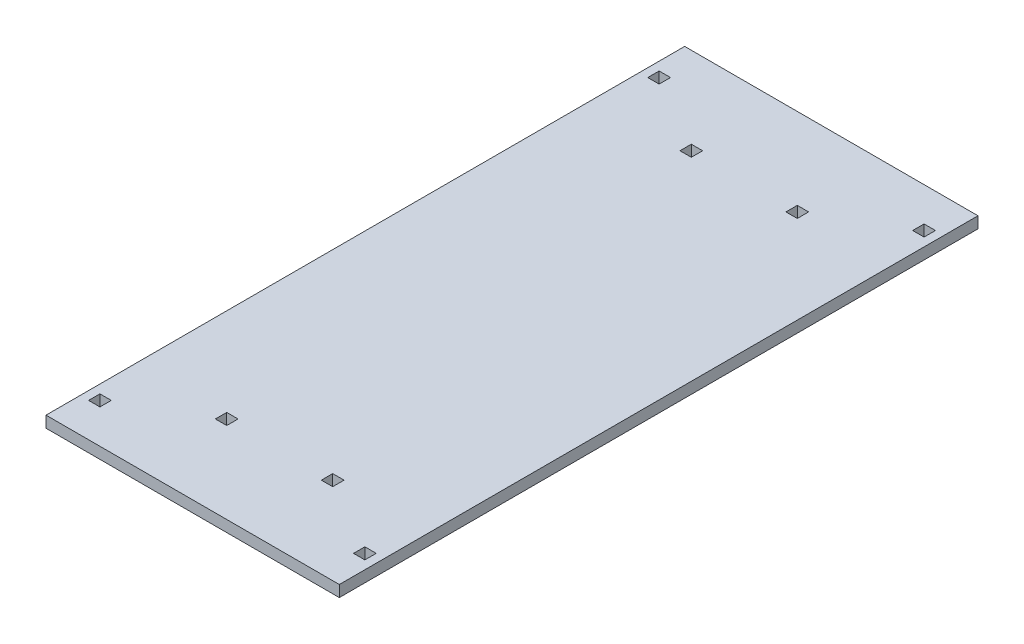
ISO-10303-21;
HEADER;
FILE_DESCRIPTION(('STEP AP214'),'2;1');
FILE_NAME('part.step','',(''),(''),'','','');
FILE_SCHEMA(('AUTOMOTIVE_DESIGN { 1 0 10303 214 1 1 1 1 }'));
ENDSEC;
DATA;
#1=APPLICATION_CONTEXT('core data for automotive mechanical design processes');
#2=APPLICATION_PROTOCOL_DEFINITION('international standard','automotive_design',2000,#1);
#3=PRODUCT_CONTEXT('',#1,'mechanical');
#4=PRODUCT('Part','Part','',(#3));
#5=PRODUCT_RELATED_PRODUCT_CATEGORY('part','',(#4));
#6=PRODUCT_DEFINITION_FORMATION('','',#4);
#7=PRODUCT_DEFINITION_CONTEXT('part definition',#1,'design');
#8=PRODUCT_DEFINITION('design','',#6,#7);
#9=PRODUCT_DEFINITION_SHAPE('','',#8);
#10=(LENGTH_UNIT() NAMED_UNIT(*) SI_UNIT(.MILLI.,.METRE.));
#11=(NAMED_UNIT(*) PLANE_ANGLE_UNIT() SI_UNIT($,.RADIAN.));
#12=(NAMED_UNIT(*) SI_UNIT($,.STERADIAN.) SOLID_ANGLE_UNIT());
#13=UNCERTAINTY_MEASURE_WITH_UNIT(LENGTH_MEASURE(1.E-05),#10,'distance_accuracy_value','');
#14=(GEOMETRIC_REPRESENTATION_CONTEXT(3) GLOBAL_UNCERTAINTY_ASSIGNED_CONTEXT((#13)) GLOBAL_UNIT_ASSIGNED_CONTEXT((#10,
#11,#12)) REPRESENTATION_CONTEXT('',''));
#15=CARTESIAN_POINT('',(0.,0.,0.));
#16=DIRECTION('',(0.,0.,1.));
#17=DIRECTION('',(1.,0.,0.));
#18=AXIS2_PLACEMENT_3D('',#15,#16,#17);
#19=CARTESIAN_POINT('',(0.,12.,0.));
#20=DIRECTION('',(0.,1.,0.));
#21=DIRECTION('',(0.,0.,1.));
#22=AXIS2_PLACEMENT_3D('',#19,#20,#21);
#23=PLANE('',#22);
#24=DIRECTION('',(0.,0.,1.));
#25=VECTOR('',#24,1.);
#26=CARTESIAN_POINT('',(-62.,12.,251.5));
#27=LINE('',#26,#25);
#28=CARTESIAN_POINT('',(-62.,12.,239.5));
#29=VERTEX_POINT('',#28);
#30=CARTESIAN_POINT('',(-62.,12.,251.5));
#31=VERTEX_POINT('',#30);
#32=EDGE_CURVE('E355',#29,#31,#27,.T.);
#33=ORIENTED_EDGE('',*,*,#32,.F.);
#34=DIRECTION('',(-1.,0.,0.));
#35=VECTOR('',#34,1.);
#36=CARTESIAN_POINT('',(-62.,12.,239.5));
#37=LINE('',#36,#35);
#38=CARTESIAN_POINT('',(-50.,12.,239.5));
#39=VERTEX_POINT('',#38);
#40=EDGE_CURVE('E345',#39,#29,#37,.T.);
#41=ORIENTED_EDGE('',*,*,#40,.F.);
#42=DIRECTION('',(0.,0.,-1.));
#43=VECTOR('',#42,1.);
#44=CARTESIAN_POINT('',(-50.,12.,251.5));
#45=LINE('',#44,#43);
#46=CARTESIAN_POINT('',(-50.,12.,251.5));
#47=VERTEX_POINT('',#46);
#48=EDGE_CURVE('E361',#47,#39,#45,.T.);
#49=ORIENTED_EDGE('',*,*,#48,.F.);
#50=DIRECTION('',(1.,0.,0.));
#51=VECTOR('',#50,1.);
#52=CARTESIAN_POINT('',(-62.,12.,251.5));
#53=LINE('',#52,#51);
#54=EDGE_CURVE('E357',#31,#47,#53,.T.);
#55=ORIENTED_EDGE('',*,*,#54,.F.);
#56=EDGE_LOOP('',(#33,#41,#49,#55));
#57=FACE_BOUND('',#56,.T.);
#58=DIRECTION('',(0.,0.,1.));
#59=VECTOR('',#58,1.);
#60=CARTESIAN_POINT('',(50.,12.,251.5));
#61=LINE('',#60,#59);
#62=CARTESIAN_POINT('',(50.,12.,239.5));
#63=VERTEX_POINT('',#62);
#64=CARTESIAN_POINT('',(50.,12.,251.5));
#65=VERTEX_POINT('',#64);
#66=EDGE_CURVE('E358',#63,#65,#61,.T.);
#67=ORIENTED_EDGE('',*,*,#66,.F.);
#68=DIRECTION('',(-1.,0.,0.));
#69=VECTOR('',#68,1.);
#70=CARTESIAN_POINT('',(50.,12.,239.5));
#71=LINE('',#70,#69);
#72=CARTESIAN_POINT('',(62.,12.,239.5));
#73=VERTEX_POINT('',#72);
#74=EDGE_CURVE('E384',#73,#63,#71,.T.);
#75=ORIENTED_EDGE('',*,*,#74,.F.);
#76=DIRECTION('',(0.,0.,-1.));
#77=VECTOR('',#76,1.);
#78=CARTESIAN_POINT('',(62.,12.,251.5));
#79=LINE('',#78,#77);
#80=CARTESIAN_POINT('',(62.,12.,251.5));
#81=VERTEX_POINT('',#80);
#82=EDGE_CURVE('E387',#81,#73,#79,.T.);
#83=ORIENTED_EDGE('',*,*,#82,.F.);
#84=DIRECTION('',(1.,0.,0.));
#85=VECTOR('',#84,1.);
#86=CARTESIAN_POINT('',(50.,12.,251.5));
#87=LINE('',#86,#85);
#88=EDGE_CURVE('E391',#65,#81,#87,.T.);
#89=ORIENTED_EDGE('',*,*,#88,.F.);
#90=EDGE_LOOP('',(#67,#75,#83,#89));
#91=FACE_BOUND('',#90,.T.);
#92=DIRECTION('',(0.,0.,1.));
#93=VECTOR('',#92,1.);
#94=CARTESIAN_POINT('',(134.,12.,289.5));
#95=LINE('',#94,#93);
#96=CARTESIAN_POINT('',(134.,12.,289.5));
#97=VERTEX_POINT('',#96);
#98=CARTESIAN_POINT('',(134.,12.,301.5));
#99=VERTEX_POINT('',#98);
#100=EDGE_CURVE('E449',#97,#99,#95,.T.);
#101=ORIENTED_EDGE('',*,*,#100,.F.);
#102=DIRECTION('',(-1.,0.,0.));
#103=VECTOR('',#102,1.);
#104=CARTESIAN_POINT('',(134.,12.,289.5));
#105=LINE('',#104,#103);
#106=CARTESIAN_POINT('',(146.,12.,289.5));
#107=VERTEX_POINT('',#106);
#108=EDGE_CURVE('E480',#107,#97,#105,.T.);
#109=ORIENTED_EDGE('',*,*,#108,.F.);
#110=DIRECTION('',(0.,0.,-1.));
#111=VECTOR('',#110,1.);
#112=CARTESIAN_POINT('',(146.,12.,289.5));
#113=LINE('',#112,#111);
#114=CARTESIAN_POINT('',(146.,12.,301.5));
#115=VERTEX_POINT('',#114);
#116=EDGE_CURVE('E483',#115,#107,#113,.T.);
#117=ORIENTED_EDGE('',*,*,#116,.F.);
#118=DIRECTION('',(1.,0.,0.));
#119=VECTOR('',#118,1.);
#120=CARTESIAN_POINT('',(134.,12.,301.5));
#121=LINE('',#120,#119);
#122=EDGE_CURVE('E487',#99,#115,#121,.T.);
#123=ORIENTED_EDGE('',*,*,#122,.F.);
#124=EDGE_LOOP('',(#101,#109,#117,#123));
#125=FACE_BOUND('',#124,.T.);
#126=DIRECTION('',(0.,0.,1.));
#127=VECTOR('',#126,1.);
#128=CARTESIAN_POINT('',(134.,12.,-301.5));
#129=LINE('',#128,#127);
#130=CARTESIAN_POINT('',(134.,12.,-301.5));
#131=VERTEX_POINT('',#130);
#132=CARTESIAN_POINT('',(134.,12.,-289.5));
#133=VERTEX_POINT('',#132);
#134=EDGE_CURVE('E415',#131,#133,#129,.T.);
#135=ORIENTED_EDGE('',*,*,#134,.F.);
#136=DIRECTION('',(-1.,0.,0.));
#137=VECTOR('',#136,1.);
#138=CARTESIAN_POINT('',(134.,12.,-301.5));
#139=LINE('',#138,#137);
#140=CARTESIAN_POINT('',(146.,12.,-301.5));
#141=VERTEX_POINT('',#140);
#142=EDGE_CURVE('E450',#141,#131,#139,.T.);
#143=ORIENTED_EDGE('',*,*,#142,.F.);
#144=DIRECTION('',(0.,0.,-1.));
#145=VECTOR('',#144,1.);
#146=CARTESIAN_POINT('',(146.,12.,-301.5));
#147=LINE('',#146,#145);
#148=CARTESIAN_POINT('',(146.,12.,-289.5));
#149=VERTEX_POINT('',#148);
#150=EDGE_CURVE('E453',#149,#141,#147,.T.);
#151=ORIENTED_EDGE('',*,*,#150,.F.);
#152=DIRECTION('',(1.,0.,0.));
#153=VECTOR('',#152,1.);
#154=CARTESIAN_POINT('',(134.,12.,-289.5));
#155=LINE('',#154,#153);
#156=EDGE_CURVE('E457',#133,#149,#155,.T.);
#157=ORIENTED_EDGE('',*,*,#156,.F.);
#158=EDGE_LOOP('',(#135,#143,#151,#157));
#159=FACE_BOUND('',#158,.T.);
#160=DIRECTION('',(0.,0.,1.));
#161=VECTOR('',#160,1.);
#162=CARTESIAN_POINT('',(-146.,12.,-301.5));
#163=LINE('',#162,#161);
#164=CARTESIAN_POINT('',(-146.,12.,-301.5));
#165=VERTEX_POINT('',#164);
#166=CARTESIAN_POINT('',(-146.,12.,-289.5));
#167=VERTEX_POINT('',#166);
#168=EDGE_CURVE('E426',#165,#167,#163,.T.);
#169=ORIENTED_EDGE('',*,*,#168,.F.);
#170=DIRECTION('',(-1.,0.,0.));
#171=VECTOR('',#170,1.);
#172=CARTESIAN_POINT('',(-146.,12.,-301.5));
#173=LINE('',#172,#171);
#174=CARTESIAN_POINT('',(-134.,12.,-301.5));
#175=VERTEX_POINT('',#174);
#176=EDGE_CURVE('E416',#175,#165,#173,.T.);
#177=ORIENTED_EDGE('',*,*,#176,.F.);
#178=DIRECTION('',(0.,0.,-1.));
#179=VECTOR('',#178,1.);
#180=CARTESIAN_POINT('',(-134.,12.,-301.5));
#181=LINE('',#180,#179);
#182=CARTESIAN_POINT('',(-134.,12.,-289.5));
#183=VERTEX_POINT('',#182);
#184=EDGE_CURVE('E419',#183,#175,#181,.T.);
#185=ORIENTED_EDGE('',*,*,#184,.F.);
#186=DIRECTION('',(1.,0.,0.));
#187=VECTOR('',#186,1.);
#188=CARTESIAN_POINT('',(-146.,12.,-289.5));
#189=LINE('',#188,#187);
#190=EDGE_CURVE('E423',#167,#183,#189,.T.);
#191=ORIENTED_EDGE('',*,*,#190,.F.);
#192=EDGE_LOOP('',(#169,#177,#185,#191));
#193=FACE_BOUND('',#192,.T.);
#194=DIRECTION('',(0.,0.,1.));
#195=VECTOR('',#194,1.);
#196=CARTESIAN_POINT('',(-146.,12.,301.5));
#197=LINE('',#196,#195);
#198=CARTESIAN_POINT('',(-146.,12.,289.5));
#199=VERTEX_POINT('',#198);
#200=CARTESIAN_POINT('',(-146.,12.,301.5));
#201=VERTEX_POINT('',#200);
#202=EDGE_CURVE('E428',#199,#201,#197,.T.);
#203=ORIENTED_EDGE('',*,*,#202,.F.);
#204=DIRECTION('',(-1.,0.,0.));
#205=VECTOR('',#204,1.);
#206=CARTESIAN_POINT('',(-134.,12.,289.5));
#207=LINE('',#206,#205);
#208=CARTESIAN_POINT('',(-134.,12.,289.5));
#209=VERTEX_POINT('',#208);
#210=EDGE_CURVE('E505',#209,#199,#207,.T.);
#211=ORIENTED_EDGE('',*,*,#210,.F.);
#212=DIRECTION('',(0.,0.,-1.));
#213=VECTOR('',#212,1.);
#214=CARTESIAN_POINT('',(-134.,12.,301.5));
#215=LINE('',#214,#213);
#216=CARTESIAN_POINT('',(-134.,12.,301.5));
#217=VERTEX_POINT('',#216);
#218=EDGE_CURVE('E519',#217,#209,#215,.T.);
#219=ORIENTED_EDGE('',*,*,#218,.F.);
#220=DIRECTION('',(1.,0.,0.));
#221=VECTOR('',#220,1.);
#222=CARTESIAN_POINT('',(-134.,12.,301.5));
#223=LINE('',#222,#221);
#224=EDGE_CURVE('E516',#201,#217,#223,.T.);
#225=ORIENTED_EDGE('',*,*,#224,.F.);
#226=EDGE_LOOP('',(#203,#211,#219,#225));
#227=FACE_BOUND('',#226,.T.);
#228=DIRECTION('',(-1.,0.,0.));
#229=VECTOR('',#228,1.);
#230=CARTESIAN_POINT('',(0.,12.,337.5));
#231=LINE('',#230,#229);
#232=CARTESIAN_POINT('',(155.,12.,337.5));
#233=VERTEX_POINT('',#232);
#234=CARTESIAN_POINT('',(-155.,12.,337.5));
#235=VERTEX_POINT('',#234);
#236=EDGE_CURVE('E533',#233,#235,#231,.T.);
#237=ORIENTED_EDGE('',*,*,#236,.F.);
#238=DIRECTION('',(0.,0.,-1.));
#239=VECTOR('',#238,1.);
#240=CARTESIAN_POINT('',(155.,12.,0.));
#241=LINE('',#240,#239);
#242=CARTESIAN_POINT('',(155.,12.,-337.5));
#243=VERTEX_POINT('',#242);
#244=EDGE_CURVE('E536',#233,#243,#241,.T.);
#245=ORIENTED_EDGE('',*,*,#244,.T.);
#246=DIRECTION('',(-1.,0.,0.));
#247=VECTOR('',#246,1.);
#248=CARTESIAN_POINT('',(0.,12.,-337.5));
#249=LINE('',#248,#247);
#250=CARTESIAN_POINT('',(-155.,12.,-337.5));
#251=VERTEX_POINT('',#250);
#252=EDGE_CURVE('E539',#243,#251,#249,.T.);
#253=ORIENTED_EDGE('',*,*,#252,.T.);
#254=DIRECTION('',(0.,0.,-1.));
#255=VECTOR('',#254,1.);
#256=CARTESIAN_POINT('',(-155.,12.,0.));
#257=LINE('',#256,#255);
#258=EDGE_CURVE('E541',#235,#251,#257,.T.);
#259=ORIENTED_EDGE('',*,*,#258,.F.);
#260=EDGE_LOOP('',(#237,#245,#253,#259));
#261=FACE_BOUND('',#260,.T.);
#262=DIRECTION('',(-1.,0.,0.));
#263=VECTOR('',#262,1.);
#264=CARTESIAN_POINT('',(50.,12.,-239.5));
#265=LINE('',#264,#263);
#266=CARTESIAN_POINT('',(62.,12.,-239.5));
#267=VERTEX_POINT('',#266);
#268=CARTESIAN_POINT('',(50.,12.,-239.5));
#269=VERTEX_POINT('',#268);
#270=EDGE_CURVE('E327',#267,#269,#265,.T.);
#271=ORIENTED_EDGE('',*,*,#270,.T.);
#272=DIRECTION('',(0.,0.,-1.));
#273=VECTOR('',#272,1.);
#274=CARTESIAN_POINT('',(50.,12.,-251.5));
#275=LINE('',#274,#273);
#276=CARTESIAN_POINT('',(50.,12.,-251.5));
#277=VERTEX_POINT('',#276);
#278=EDGE_CURVE('E64',#269,#277,#275,.T.);
#279=ORIENTED_EDGE('',*,*,#278,.T.);
#280=DIRECTION('',(1.,0.,0.));
#281=VECTOR('',#280,1.);
#282=CARTESIAN_POINT('',(50.,12.,-251.5));
#283=LINE('',#282,#281);
#284=CARTESIAN_POINT('',(62.,12.,-251.5));
#285=VERTEX_POINT('',#284);
#286=EDGE_CURVE('E318',#277,#285,#283,.T.);
#287=ORIENTED_EDGE('',*,*,#286,.T.);
#288=DIRECTION('',(0.,0.,1.));
#289=VECTOR('',#288,1.);
#290=CARTESIAN_POINT('',(62.,12.,-251.5));
#291=LINE('',#290,#289);
#292=EDGE_CURVE('E330',#285,#267,#291,.T.);
#293=ORIENTED_EDGE('',*,*,#292,.T.);
#294=EDGE_LOOP('',(#271,#279,#287,#293));
#295=FACE_BOUND('',#294,.T.);
#296=DIRECTION('',(-1.,0.,0.));
#297=VECTOR('',#296,1.);
#298=CARTESIAN_POINT('',(-62.,12.,-239.5));
#299=LINE('',#298,#297);
#300=CARTESIAN_POINT('',(-50.,12.,-239.5));
#301=VERTEX_POINT('',#300);
#302=CARTESIAN_POINT('',(-62.,12.,-239.5));
#303=VERTEX_POINT('',#302);
#304=EDGE_CURVE('E304',#301,#303,#299,.T.);
#305=ORIENTED_EDGE('',*,*,#304,.T.);
#306=DIRECTION('',(0.,0.,-1.));
#307=VECTOR('',#306,1.);
#308=CARTESIAN_POINT('',(-62.,12.,-251.5));
#309=LINE('',#308,#307);
#310=CARTESIAN_POINT('',(-62.,12.,-251.5));
#311=VERTEX_POINT('',#310);
#312=EDGE_CURVE('E56',#303,#311,#309,.T.);
#313=ORIENTED_EDGE('',*,*,#312,.T.);
#314=DIRECTION('',(1.,0.,0.));
#315=VECTOR('',#314,1.);
#316=CARTESIAN_POINT('',(-62.,12.,-251.5));
#317=LINE('',#316,#315);
#318=CARTESIAN_POINT('',(-50.,12.,-251.5));
#319=VERTEX_POINT('',#318);
#320=EDGE_CURVE('E295',#311,#319,#317,.T.);
#321=ORIENTED_EDGE('',*,*,#320,.T.);
#322=DIRECTION('',(0.,0.,1.));
#323=VECTOR('',#322,1.);
#324=CARTESIAN_POINT('',(-50.,12.,-251.5));
#325=LINE('',#324,#323);
#326=EDGE_CURVE('E298',#319,#301,#325,.T.);
#327=ORIENTED_EDGE('',*,*,#326,.T.);
#328=EDGE_LOOP('',(#305,#313,#321,#327));
#329=FACE_BOUND('',#328,.T.);
#330=ADVANCED_FACE('F41',(#57,#91,#125,#159,#193,#227,#261,#295,#329),#23,.T.);
#331=CARTESIAN_POINT('',(0.,0.,0.));
#332=DIRECTION('',(0.,1.,0.));
#333=DIRECTION('',(0.,0.,1.));
#334=AXIS2_PLACEMENT_3D('',#331,#332,#333);
#335=PLANE('',#334);
#336=DIRECTION('',(0.,0.,-1.));
#337=VECTOR('',#336,1.);
#338=CARTESIAN_POINT('',(50.,0.,-251.5));
#339=LINE('',#338,#337);
#340=CARTESIAN_POINT('',(50.,0.,-239.5));
#341=VERTEX_POINT('',#340);
#342=CARTESIAN_POINT('',(50.,0.,-251.5));
#343=VERTEX_POINT('',#342);
#344=EDGE_CURVE('E315',#341,#343,#339,.T.);
#345=ORIENTED_EDGE('',*,*,#344,.F.);
#346=DIRECTION('',(-1.,0.,0.));
#347=VECTOR('',#346,1.);
#348=CARTESIAN_POINT('',(50.,0.,-239.5));
#349=LINE('',#348,#347);
#350=CARTESIAN_POINT('',(62.,0.,-239.5));
#351=VERTEX_POINT('',#350);
#352=EDGE_CURVE('E317',#351,#341,#349,.T.);
#353=ORIENTED_EDGE('',*,*,#352,.F.);
#354=DIRECTION('',(0.,0.,1.));
#355=VECTOR('',#354,1.);
#356=CARTESIAN_POINT('',(62.,0.,-251.5));
#357=LINE('',#356,#355);
#358=CARTESIAN_POINT('',(62.,0.,-251.5));
#359=VERTEX_POINT('',#358);
#360=EDGE_CURVE('E320',#359,#351,#357,.T.);
#361=ORIENTED_EDGE('',*,*,#360,.F.);
#362=DIRECTION('',(1.,0.,0.));
#363=VECTOR('',#362,1.);
#364=CARTESIAN_POINT('',(50.,0.,-251.5));
#365=LINE('',#364,#363);
#366=EDGE_CURVE('E323',#343,#359,#365,.T.);
#367=ORIENTED_EDGE('',*,*,#366,.F.);
#368=EDGE_LOOP('',(#345,#353,#361,#367));
#369=FACE_BOUND('',#368,.T.);
#370=DIRECTION('',(-1.,0.,0.));
#371=VECTOR('',#370,1.);
#372=CARTESIAN_POINT('',(-62.,0.,239.5));
#373=LINE('',#372,#371);
#374=CARTESIAN_POINT('',(-50.,0.,239.5));
#375=VERTEX_POINT('',#374);
#376=CARTESIAN_POINT('',(-62.,0.,239.5));
#377=VERTEX_POINT('',#376);
#378=EDGE_CURVE('E351',#375,#377,#373,.T.);
#379=ORIENTED_EDGE('',*,*,#378,.T.);
#380=DIRECTION('',(0.,0.,1.));
#381=VECTOR('',#380,1.);
#382=CARTESIAN_POINT('',(-62.,0.,251.5));
#383=LINE('',#382,#381);
#384=CARTESIAN_POINT('',(-62.,0.,251.5));
#385=VERTEX_POINT('',#384);
#386=EDGE_CURVE('E341',#377,#385,#383,.T.);
#387=ORIENTED_EDGE('',*,*,#386,.T.);
#388=DIRECTION('',(1.,0.,0.));
#389=VECTOR('',#388,1.);
#390=CARTESIAN_POINT('',(-62.,0.,251.5));
#391=LINE('',#390,#389);
#392=CARTESIAN_POINT('',(-50.,0.,251.5));
#393=VERTEX_POINT('',#392);
#394=EDGE_CURVE('E344',#385,#393,#391,.T.);
#395=ORIENTED_EDGE('',*,*,#394,.T.);
#396=DIRECTION('',(0.,0.,-1.));
#397=VECTOR('',#396,1.);
#398=CARTESIAN_POINT('',(-50.,0.,251.5));
#399=LINE('',#398,#397);
#400=EDGE_CURVE('E348',#393,#375,#399,.T.);
#401=ORIENTED_EDGE('',*,*,#400,.T.);
#402=EDGE_LOOP('',(#379,#387,#395,#401));
#403=FACE_BOUND('',#402,.T.);
#404=DIRECTION('',(-1.,0.,0.));
#405=VECTOR('',#404,1.);
#406=CARTESIAN_POINT('',(50.,0.,239.5));
#407=LINE('',#406,#405);
#408=CARTESIAN_POINT('',(62.,0.,239.5));
#409=VERTEX_POINT('',#408);
#410=CARTESIAN_POINT('',(50.,0.,239.5));
#411=VERTEX_POINT('',#410);
#412=EDGE_CURVE('E378',#409,#411,#407,.T.);
#413=ORIENTED_EDGE('',*,*,#412,.T.);
#414=DIRECTION('',(0.,0.,1.));
#415=VECTOR('',#414,1.);
#416=CARTESIAN_POINT('',(50.,0.,251.5));
#417=LINE('',#416,#415);
#418=CARTESIAN_POINT('',(50.,0.,251.5));
#419=VERTEX_POINT('',#418);
#420=EDGE_CURVE('E388',#411,#419,#417,.T.);
#421=ORIENTED_EDGE('',*,*,#420,.T.);
#422=DIRECTION('',(1.,0.,0.));
#423=VECTOR('',#422,1.);
#424=CARTESIAN_POINT('',(50.,0.,251.5));
#425=LINE('',#424,#423);
#426=CARTESIAN_POINT('',(62.,0.,251.5));
#427=VERTEX_POINT('',#426);
#428=EDGE_CURVE('E400',#419,#427,#425,.T.);
#429=ORIENTED_EDGE('',*,*,#428,.T.);
#430=DIRECTION('',(0.,0.,-1.));
#431=VECTOR('',#430,1.);
#432=CARTESIAN_POINT('',(62.,0.,251.5));
#433=LINE('',#432,#431);
#434=EDGE_CURVE('E397',#427,#409,#433,.T.);
#435=ORIENTED_EDGE('',*,*,#434,.T.);
#436=EDGE_LOOP('',(#413,#421,#429,#435));
#437=FACE_BOUND('',#436,.T.);
#438=DIRECTION('',(-1.,0.,0.));
#439=VECTOR('',#438,1.);
#440=CARTESIAN_POINT('',(134.,0.,289.5));
#441=LINE('',#440,#439);
#442=CARTESIAN_POINT('',(146.,0.,289.5));
#443=VERTEX_POINT('',#442);
#444=CARTESIAN_POINT('',(134.,0.,289.5));
#445=VERTEX_POINT('',#444);
#446=EDGE_CURVE('E474',#443,#445,#441,.T.);
#447=ORIENTED_EDGE('',*,*,#446,.T.);
#448=DIRECTION('',(0.,0.,1.));
#449=VECTOR('',#448,1.);
#450=CARTESIAN_POINT('',(134.,0.,289.5));
#451=LINE('',#450,#449);
#452=CARTESIAN_POINT('',(134.,0.,301.5));
#453=VERTEX_POINT('',#452);
#454=EDGE_CURVE('E484',#445,#453,#451,.T.);
#455=ORIENTED_EDGE('',*,*,#454,.T.);
#456=DIRECTION('',(1.,0.,0.));
#457=VECTOR('',#456,1.);
#458=CARTESIAN_POINT('',(134.,0.,301.5));
#459=LINE('',#458,#457);
#460=CARTESIAN_POINT('',(146.,0.,301.5));
#461=VERTEX_POINT('',#460);
#462=EDGE_CURVE('E496',#453,#461,#459,.T.);
#463=ORIENTED_EDGE('',*,*,#462,.T.);
#464=DIRECTION('',(0.,0.,-1.));
#465=VECTOR('',#464,1.);
#466=CARTESIAN_POINT('',(146.,0.,289.5));
#467=LINE('',#466,#465);
#468=EDGE_CURVE('E493',#461,#443,#467,.T.);
#469=ORIENTED_EDGE('',*,*,#468,.T.);
#470=EDGE_LOOP('',(#447,#455,#463,#469));
#471=FACE_BOUND('',#470,.T.);
#472=DIRECTION('',(-1.,0.,0.));
#473=VECTOR('',#472,1.);
#474=CARTESIAN_POINT('',(134.,0.,-301.5));
#475=LINE('',#474,#473);
#476=CARTESIAN_POINT('',(146.,0.,-301.5));
#477=VERTEX_POINT('',#476);
#478=CARTESIAN_POINT('',(134.,0.,-301.5));
#479=VERTEX_POINT('',#478);
#480=EDGE_CURVE('E442',#477,#479,#475,.T.);
#481=ORIENTED_EDGE('',*,*,#480,.T.);
#482=DIRECTION('',(0.,0.,1.));
#483=VECTOR('',#482,1.);
#484=CARTESIAN_POINT('',(134.,0.,-301.5));
#485=LINE('',#484,#483);
#486=CARTESIAN_POINT('',(134.,0.,-289.5));
#487=VERTEX_POINT('',#486);
#488=EDGE_CURVE('E454',#479,#487,#485,.T.);
#489=ORIENTED_EDGE('',*,*,#488,.T.);
#490=DIRECTION('',(1.,0.,0.));
#491=VECTOR('',#490,1.);
#492=CARTESIAN_POINT('',(134.,0.,-289.5));
#493=LINE('',#492,#491);
#494=CARTESIAN_POINT('',(146.,0.,-289.5));
#495=VERTEX_POINT('',#494);
#496=EDGE_CURVE('E466',#487,#495,#493,.T.);
#497=ORIENTED_EDGE('',*,*,#496,.T.);
#498=DIRECTION('',(0.,0.,-1.));
#499=VECTOR('',#498,1.);
#500=CARTESIAN_POINT('',(146.,0.,-301.5));
#501=LINE('',#500,#499);
#502=EDGE_CURVE('E463',#495,#477,#501,.T.);
#503=ORIENTED_EDGE('',*,*,#502,.T.);
#504=EDGE_LOOP('',(#481,#489,#497,#503));
#505=FACE_BOUND('',#504,.T.);
#506=DIRECTION('',(-1.,0.,0.));
#507=VECTOR('',#506,1.);
#508=CARTESIAN_POINT('',(-146.,0.,-301.5));
#509=LINE('',#508,#507);
#510=CARTESIAN_POINT('',(-134.,0.,-301.5));
#511=VERTEX_POINT('',#510);
#512=CARTESIAN_POINT('',(-146.,0.,-301.5));
#513=VERTEX_POINT('',#512);
#514=EDGE_CURVE('E408',#511,#513,#509,.T.);
#515=ORIENTED_EDGE('',*,*,#514,.T.);
#516=DIRECTION('',(0.,0.,1.));
#517=VECTOR('',#516,1.);
#518=CARTESIAN_POINT('',(-146.,0.,-301.5));
#519=LINE('',#518,#517);
#520=CARTESIAN_POINT('',(-146.,0.,-289.5));
#521=VERTEX_POINT('',#520);
#522=EDGE_CURVE('E420',#513,#521,#519,.T.);
#523=ORIENTED_EDGE('',*,*,#522,.T.);
#524=DIRECTION('',(1.,0.,0.));
#525=VECTOR('',#524,1.);
#526=CARTESIAN_POINT('',(-146.,0.,-289.5));
#527=LINE('',#526,#525);
#528=CARTESIAN_POINT('',(-134.,0.,-289.5));
#529=VERTEX_POINT('',#528);
#530=EDGE_CURVE('E434',#521,#529,#527,.T.);
#531=ORIENTED_EDGE('',*,*,#530,.T.);
#532=DIRECTION('',(0.,0.,-1.));
#533=VECTOR('',#532,1.);
#534=CARTESIAN_POINT('',(-134.,0.,-301.5));
#535=LINE('',#534,#533);
#536=EDGE_CURVE('E431',#529,#511,#535,.T.);
#537=ORIENTED_EDGE('',*,*,#536,.T.);
#538=EDGE_LOOP('',(#515,#523,#531,#537));
#539=FACE_BOUND('',#538,.T.);
#540=DIRECTION('',(-1.,0.,0.));
#541=VECTOR('',#540,1.);
#542=CARTESIAN_POINT('',(-134.,0.,289.5));
#543=LINE('',#542,#541);
#544=CARTESIAN_POINT('',(-134.,0.,289.5));
#545=VERTEX_POINT('',#544);
#546=CARTESIAN_POINT('',(-146.,0.,289.5));
#547=VERTEX_POINT('',#546);
#548=EDGE_CURVE('E511',#545,#547,#543,.T.);
#549=ORIENTED_EDGE('',*,*,#548,.T.);
#550=DIRECTION('',(0.,0.,1.));
#551=VECTOR('',#550,1.);
#552=CARTESIAN_POINT('',(-146.,0.,301.5));
#553=LINE('',#552,#551);
#554=CARTESIAN_POINT('',(-146.,0.,301.5));
#555=VERTEX_POINT('',#554);
#556=EDGE_CURVE('E501',#547,#555,#553,.T.);
#557=ORIENTED_EDGE('',*,*,#556,.T.);
#558=DIRECTION('',(1.,0.,0.));
#559=VECTOR('',#558,1.);
#560=CARTESIAN_POINT('',(-134.,0.,301.5));
#561=LINE('',#560,#559);
#562=CARTESIAN_POINT('',(-134.,0.,301.5));
#563=VERTEX_POINT('',#562);
#564=EDGE_CURVE('E504',#555,#563,#561,.T.);
#565=ORIENTED_EDGE('',*,*,#564,.T.);
#566=DIRECTION('',(0.,0.,-1.));
#567=VECTOR('',#566,1.);
#568=CARTESIAN_POINT('',(-134.,0.,301.5));
#569=LINE('',#568,#567);
#570=EDGE_CURVE('E508',#563,#545,#569,.T.);
#571=ORIENTED_EDGE('',*,*,#570,.T.);
#572=EDGE_LOOP('',(#549,#557,#565,#571));
#573=FACE_BOUND('',#572,.T.);
#574=DIRECTION('',(-1.,0.,0.));
#575=VECTOR('',#574,1.);
#576=CARTESIAN_POINT('',(0.,0.,337.5));
#577=LINE('',#576,#575);
#578=CARTESIAN_POINT('',(155.,0.,337.5));
#579=VERTEX_POINT('',#578);
#580=CARTESIAN_POINT('',(-155.,0.,337.5));
#581=VERTEX_POINT('',#580);
#582=EDGE_CURVE('E526',#579,#581,#577,.T.);
#583=ORIENTED_EDGE('',*,*,#582,.T.);
#584=DIRECTION('',(0.,0.,-1.));
#585=VECTOR('',#584,1.);
#586=CARTESIAN_POINT('',(-155.,0.,0.));
#587=LINE('',#586,#585);
#588=CARTESIAN_POINT('',(-155.,0.,-337.5));
#589=VERTEX_POINT('',#588);
#590=EDGE_CURVE('E537',#581,#589,#587,.T.);
#591=ORIENTED_EDGE('',*,*,#590,.T.);
#592=DIRECTION('',(-1.,0.,0.));
#593=VECTOR('',#592,1.);
#594=CARTESIAN_POINT('',(0.,0.,-337.5));
#595=LINE('',#594,#593);
#596=CARTESIAN_POINT('',(155.,0.,-337.5));
#597=VERTEX_POINT('',#596);
#598=EDGE_CURVE('E549',#597,#589,#595,.T.);
#599=ORIENTED_EDGE('',*,*,#598,.F.);
#600=DIRECTION('',(0.,0.,-1.));
#601=VECTOR('',#600,1.);
#602=CARTESIAN_POINT('',(155.,0.,0.));
#603=LINE('',#602,#601);
#604=EDGE_CURVE('E547',#579,#597,#603,.T.);
#605=ORIENTED_EDGE('',*,*,#604,.F.);
#606=EDGE_LOOP('',(#583,#591,#599,#605));
#607=FACE_BOUND('',#606,.T.);
#608=DIRECTION('',(0.,0.,-1.));
#609=VECTOR('',#608,1.);
#610=CARTESIAN_POINT('',(-62.,0.,-251.5));
#611=LINE('',#610,#609);
#612=CARTESIAN_POINT('',(-62.,0.,-239.5));
#613=VERTEX_POINT('',#612);
#614=CARTESIAN_POINT('',(-62.,0.,-251.5));
#615=VERTEX_POINT('',#614);
#616=EDGE_CURVE('E287',#613,#615,#611,.T.);
#617=ORIENTED_EDGE('',*,*,#616,.F.);
#618=DIRECTION('',(-1.,0.,0.));
#619=VECTOR('',#618,1.);
#620=CARTESIAN_POINT('',(-62.,0.,-239.5));
#621=LINE('',#620,#619);
#622=CARTESIAN_POINT('',(-50.,0.,-239.5));
#623=VERTEX_POINT('',#622);
#624=EDGE_CURVE('E276',#623,#613,#621,.T.);
#625=ORIENTED_EDGE('',*,*,#624,.F.);
#626=DIRECTION('',(0.,0.,1.));
#627=VECTOR('',#626,1.);
#628=CARTESIAN_POINT('',(-50.,0.,-251.5));
#629=LINE('',#628,#627);
#630=CARTESIAN_POINT('',(-50.,0.,-251.5));
#631=VERTEX_POINT('',#630);
#632=EDGE_CURVE('E286',#631,#623,#629,.T.);
#633=ORIENTED_EDGE('',*,*,#632,.F.);
#634=DIRECTION('',(1.,0.,0.));
#635=VECTOR('',#634,1.);
#636=CARTESIAN_POINT('',(-62.,0.,-251.5));
#637=LINE('',#636,#635);
#638=EDGE_CURVE('E291',#615,#631,#637,.T.);
#639=ORIENTED_EDGE('',*,*,#638,.F.);
#640=EDGE_LOOP('',(#617,#625,#633,#639));
#641=FACE_BOUND('',#640,.T.);
#642=ADVANCED_FACE('F294',(#369,#403,#437,#471,#505,#539,#573,#607,#641),#335,.F.);
#643=CARTESIAN_POINT('',(0.,12.,337.5));
#644=DIRECTION('',(0.,0.,1.));
#645=DIRECTION('',(1.,0.,0.));
#646=AXIS2_PLACEMENT_3D('',#643,#644,#645);
#647=PLANE('',#646);
#648=ORIENTED_EDGE('',*,*,#582,.F.);
#649=DIRECTION('',(0.,-1.,0.));
#650=VECTOR('',#649,1.);
#651=CARTESIAN_POINT('',(155.,12.,337.5));
#652=LINE('',#651,#650);
#653=EDGE_CURVE('E11',#233,#579,#652,.T.);
#654=ORIENTED_EDGE('',*,*,#653,.F.);
#655=ORIENTED_EDGE('',*,*,#236,.T.);
#656=DIRECTION('',(0.,-1.,0.));
#657=VECTOR('',#656,1.);
#658=CARTESIAN_POINT('',(-155.,12.,337.5));
#659=LINE('',#658,#657);
#660=EDGE_CURVE('E544',#235,#581,#659,.T.);
#661=ORIENTED_EDGE('',*,*,#660,.T.);
#662=EDGE_LOOP('',(#648,#654,#655,#661));
#663=FACE_BOUND('',#662,.T.);
#664=ADVANCED_FACE('F43',(#663),#647,.T.);
#665=CARTESIAN_POINT('',(155.,12.,0.));
#666=DIRECTION('',(-1.,0.,0.));
#667=DIRECTION('',(0.,0.,1.));
#668=AXIS2_PLACEMENT_3D('',#665,#666,#667);
#669=PLANE('',#668);
#670=ORIENTED_EDGE('',*,*,#604,.T.);
#671=DIRECTION('',(0.,-1.,0.));
#672=VECTOR('',#671,1.);
#673=CARTESIAN_POINT('',(155.,12.,-337.5));
#674=LINE('',#673,#672);
#675=EDGE_CURVE('E49',#243,#597,#674,.T.);
#676=ORIENTED_EDGE('',*,*,#675,.F.);
#677=ORIENTED_EDGE('',*,*,#244,.F.);
#678=ORIENTED_EDGE('',*,*,#653,.T.);
#679=EDGE_LOOP('',(#670,#676,#677,#678));
#680=FACE_BOUND('',#679,.T.);
#681=ADVANCED_FACE('F575',(#680),#669,.F.);
#682=CARTESIAN_POINT('',(0.,12.,-337.5));
#683=DIRECTION('',(0.,0.,1.));
#684=DIRECTION('',(1.,0.,0.));
#685=AXIS2_PLACEMENT_3D('',#682,#683,#684);
#686=PLANE('',#685);
#687=ORIENTED_EDGE('',*,*,#598,.T.);
#688=DIRECTION('',(0.,-1.,0.));
#689=VECTOR('',#688,1.);
#690=CARTESIAN_POINT('',(-155.,12.,-337.5));
#691=LINE('',#690,#689);
#692=EDGE_CURVE('E555',#251,#589,#691,.T.);
#693=ORIENTED_EDGE('',*,*,#692,.F.);
#694=ORIENTED_EDGE('',*,*,#252,.F.);
#695=ORIENTED_EDGE('',*,*,#675,.T.);
#696=EDGE_LOOP('',(#687,#693,#694,#695));
#697=FACE_BOUND('',#696,.T.);
#698=ADVANCED_FACE('F561',(#697),#686,.F.);
#699=CARTESIAN_POINT('',(-155.,12.,0.));
#700=DIRECTION('',(-1.,0.,0.));
#701=DIRECTION('',(0.,0.,1.));
#702=AXIS2_PLACEMENT_3D('',#699,#700,#701);
#703=PLANE('',#702);
#704=ORIENTED_EDGE('',*,*,#590,.F.);
#705=ORIENTED_EDGE('',*,*,#660,.F.);
#706=ORIENTED_EDGE('',*,*,#258,.T.);
#707=ORIENTED_EDGE('',*,*,#692,.T.);
#708=EDGE_LOOP('',(#704,#705,#706,#707));
#709=FACE_BOUND('',#708,.T.);
#710=ADVANCED_FACE('F570',(#709),#703,.T.);
#711=CARTESIAN_POINT('',(-146.,0.,301.5));
#712=DIRECTION('',(-1.,0.,0.));
#713=DIRECTION('',(0.,0.,1.));
#714=AXIS2_PLACEMENT_3D('',#711,#712,#713);
#715=PLANE('',#714);
#716=ORIENTED_EDGE('',*,*,#202,.T.);
#717=DIRECTION('',(0.,1.,0.));
#718=VECTOR('',#717,1.);
#719=CARTESIAN_POINT('',(-146.,0.,301.5));
#720=LINE('',#719,#718);
#721=EDGE_CURVE('E514',#555,#201,#720,.T.);
#722=ORIENTED_EDGE('',*,*,#721,.F.);
#723=ORIENTED_EDGE('',*,*,#556,.F.);
#724=DIRECTION('',(0.,1.,0.));
#725=VECTOR('',#724,1.);
#726=CARTESIAN_POINT('',(-146.,0.,289.5));
#727=LINE('',#726,#725);
#728=EDGE_CURVE('E524',#547,#199,#727,.T.);
#729=ORIENTED_EDGE('',*,*,#728,.T.);
#730=EDGE_LOOP('',(#716,#722,#723,#729));
#731=FACE_BOUND('',#730,.T.);
#732=ADVANCED_FACE('F592',(#731),#715,.F.);
#733=CARTESIAN_POINT('',(-134.,0.,289.5));
#734=DIRECTION('',(0.,0.,-1.));
#735=DIRECTION('',(-1.,0.,0.));
#736=AXIS2_PLACEMENT_3D('',#733,#734,#735);
#737=PLANE('',#736);
#738=ORIENTED_EDGE('',*,*,#210,.T.);
#739=ORIENTED_EDGE('',*,*,#728,.F.);
#740=ORIENTED_EDGE('',*,*,#548,.F.);
#741=DIRECTION('',(0.,1.,0.));
#742=VECTOR('',#741,1.);
#743=CARTESIAN_POINT('',(-134.,0.,289.5));
#744=LINE('',#743,#742);
#745=EDGE_CURVE('E527',#545,#209,#744,.T.);
#746=ORIENTED_EDGE('',*,*,#745,.T.);
#747=EDGE_LOOP('',(#738,#739,#740,#746));
#748=FACE_BOUND('',#747,.T.);
#749=ADVANCED_FACE('F612',(#748),#737,.F.);
#750=CARTESIAN_POINT('',(-134.,0.,301.5));
#751=DIRECTION('',(1.,0.,0.));
#752=DIRECTION('',(0.,0.,-1.));
#753=AXIS2_PLACEMENT_3D('',#750,#751,#752);
#754=PLANE('',#753);
#755=ORIENTED_EDGE('',*,*,#218,.T.);
#756=ORIENTED_EDGE('',*,*,#745,.F.);
#757=ORIENTED_EDGE('',*,*,#570,.F.);
#758=DIRECTION('',(0.,1.,0.));
#759=VECTOR('',#758,1.);
#760=CARTESIAN_POINT('',(-134.,0.,301.5));
#761=LINE('',#760,#759);
#762=EDGE_CURVE('E529',#563,#217,#761,.T.);
#763=ORIENTED_EDGE('',*,*,#762,.T.);
#764=EDGE_LOOP('',(#755,#756,#757,#763));
#765=FACE_BOUND('',#764,.T.);
#766=ADVANCED_FACE('F619',(#765),#754,.F.);
#767=CARTESIAN_POINT('',(-134.,0.,301.5));
#768=DIRECTION('',(0.,0.,1.));
#769=DIRECTION('',(1.,0.,0.));
#770=AXIS2_PLACEMENT_3D('',#767,#768,#769);
#771=PLANE('',#770);
#772=ORIENTED_EDGE('',*,*,#224,.T.);
#773=ORIENTED_EDGE('',*,*,#762,.F.);
#774=ORIENTED_EDGE('',*,*,#564,.F.);
#775=ORIENTED_EDGE('',*,*,#721,.T.);
#776=EDGE_LOOP('',(#772,#773,#774,#775));
#777=FACE_BOUND('',#776,.T.);
#778=ADVANCED_FACE('F627',(#777),#771,.F.);
#779=CARTESIAN_POINT('',(-146.,0.,-301.5));
#780=DIRECTION('',(-1.,0.,0.));
#781=DIRECTION('',(0.,0.,1.));
#782=AXIS2_PLACEMENT_3D('',#779,#780,#781);
#783=PLANE('',#782);
#784=ORIENTED_EDGE('',*,*,#168,.T.);
#785=DIRECTION('',(0.,1.,0.));
#786=VECTOR('',#785,1.);
#787=CARTESIAN_POINT('',(-146.,0.,-289.5));
#788=LINE('',#787,#786);
#789=EDGE_CURVE('E405',#521,#167,#788,.T.);
#790=ORIENTED_EDGE('',*,*,#789,.F.);
#791=ORIENTED_EDGE('',*,*,#522,.F.);
#792=DIRECTION('',(0.,1.,0.));
#793=VECTOR('',#792,1.);
#794=CARTESIAN_POINT('',(-146.,0.,-301.5));
#795=LINE('',#794,#793);
#796=EDGE_CURVE('E413',#513,#165,#795,.T.);
#797=ORIENTED_EDGE('',*,*,#796,.T.);
#798=EDGE_LOOP('',(#784,#790,#791,#797));
#799=FACE_BOUND('',#798,.T.);
#800=ADVANCED_FACE('F635',(#799),#783,.F.);
#801=CARTESIAN_POINT('',(-146.,0.,-301.5));
#802=DIRECTION('',(0.,0.,-1.));
#803=DIRECTION('',(-1.,0.,0.));
#804=AXIS2_PLACEMENT_3D('',#801,#802,#803);
#805=PLANE('',#804);
#806=ORIENTED_EDGE('',*,*,#176,.T.);
#807=ORIENTED_EDGE('',*,*,#796,.F.);
#808=ORIENTED_EDGE('',*,*,#514,.F.);
#809=DIRECTION('',(0.,1.,0.));
#810=VECTOR('',#809,1.);
#811=CARTESIAN_POINT('',(-134.,0.,-301.5));
#812=LINE('',#811,#810);
#813=EDGE_CURVE('E411',#511,#175,#812,.T.);
#814=ORIENTED_EDGE('',*,*,#813,.T.);
#815=EDGE_LOOP('',(#806,#807,#808,#814));
#816=FACE_BOUND('',#815,.T.);
#817=ADVANCED_FACE('F642',(#816),#805,.F.);
#818=CARTESIAN_POINT('',(-134.,0.,-301.5));
#819=DIRECTION('',(1.,0.,0.));
#820=DIRECTION('',(0.,0.,-1.));
#821=AXIS2_PLACEMENT_3D('',#818,#819,#820);
#822=PLANE('',#821);
#823=ORIENTED_EDGE('',*,*,#184,.T.);
#824=ORIENTED_EDGE('',*,*,#813,.F.);
#825=ORIENTED_EDGE('',*,*,#536,.F.);
#826=DIRECTION('',(0.,1.,0.));
#827=VECTOR('',#826,1.);
#828=CARTESIAN_POINT('',(-134.,0.,-289.5));
#829=LINE('',#828,#827);
#830=EDGE_CURVE('E409',#529,#183,#829,.T.);
#831=ORIENTED_EDGE('',*,*,#830,.T.);
#832=EDGE_LOOP('',(#823,#824,#825,#831));
#833=FACE_BOUND('',#832,.T.);
#834=ADVANCED_FACE('F650',(#833),#822,.F.);
#835=CARTESIAN_POINT('',(-146.,0.,-289.5));
#836=DIRECTION('',(0.,0.,1.));
#837=DIRECTION('',(1.,0.,0.));
#838=AXIS2_PLACEMENT_3D('',#835,#836,#837);
#839=PLANE('',#838);
#840=ORIENTED_EDGE('',*,*,#190,.T.);
#841=ORIENTED_EDGE('',*,*,#830,.F.);
#842=ORIENTED_EDGE('',*,*,#530,.F.);
#843=ORIENTED_EDGE('',*,*,#789,.T.);
#844=EDGE_LOOP('',(#840,#841,#842,#843));
#845=FACE_BOUND('',#844,.T.);
#846=ADVANCED_FACE('F658',(#845),#839,.F.);
#847=CARTESIAN_POINT('',(134.,0.,-301.5));
#848=DIRECTION('',(-1.,0.,0.));
#849=DIRECTION('',(0.,0.,1.));
#850=AXIS2_PLACEMENT_3D('',#847,#848,#849);
#851=PLANE('',#850);
#852=ORIENTED_EDGE('',*,*,#134,.T.);
#853=DIRECTION('',(0.,1.,0.));
#854=VECTOR('',#853,1.);
#855=CARTESIAN_POINT('',(134.,0.,-289.5));
#856=LINE('',#855,#854);
#857=EDGE_CURVE('E439',#487,#133,#856,.T.);
#858=ORIENTED_EDGE('',*,*,#857,.F.);
#859=ORIENTED_EDGE('',*,*,#488,.F.);
#860=DIRECTION('',(0.,1.,0.));
#861=VECTOR('',#860,1.);
#862=CARTESIAN_POINT('',(134.,0.,-301.5));
#863=LINE('',#862,#861);
#864=EDGE_CURVE('E447',#479,#131,#863,.T.);
#865=ORIENTED_EDGE('',*,*,#864,.T.);
#866=EDGE_LOOP('',(#852,#858,#859,#865));
#867=FACE_BOUND('',#866,.T.);
#868=ADVANCED_FACE('F666',(#867),#851,.F.);
#869=CARTESIAN_POINT('',(134.,0.,-301.5));
#870=DIRECTION('',(0.,0.,-1.));
#871=DIRECTION('',(-1.,0.,0.));
#872=AXIS2_PLACEMENT_3D('',#869,#870,#871);
#873=PLANE('',#872);
#874=ORIENTED_EDGE('',*,*,#142,.T.);
#875=ORIENTED_EDGE('',*,*,#864,.F.);
#876=ORIENTED_EDGE('',*,*,#480,.F.);
#877=DIRECTION('',(0.,1.,0.));
#878=VECTOR('',#877,1.);
#879=CARTESIAN_POINT('',(146.,0.,-301.5));
#880=LINE('',#879,#878);
#881=EDGE_CURVE('E445',#477,#141,#880,.T.);
#882=ORIENTED_EDGE('',*,*,#881,.T.);
#883=EDGE_LOOP('',(#874,#875,#876,#882));
#884=FACE_BOUND('',#883,.T.);
#885=ADVANCED_FACE('F674',(#884),#873,.F.);
#886=CARTESIAN_POINT('',(146.,0.,-301.5));
#887=DIRECTION('',(1.,0.,0.));
#888=DIRECTION('',(0.,0.,-1.));
#889=AXIS2_PLACEMENT_3D('',#886,#887,#888);
#890=PLANE('',#889);
#891=ORIENTED_EDGE('',*,*,#150,.T.);
#892=ORIENTED_EDGE('',*,*,#881,.F.);
#893=ORIENTED_EDGE('',*,*,#502,.F.);
#894=DIRECTION('',(0.,1.,0.));
#895=VECTOR('',#894,1.);
#896=CARTESIAN_POINT('',(146.,0.,-289.5));
#897=LINE('',#896,#895);
#898=EDGE_CURVE('E443',#495,#149,#897,.T.);
#899=ORIENTED_EDGE('',*,*,#898,.T.);
#900=EDGE_LOOP('',(#891,#892,#893,#899));
#901=FACE_BOUND('',#900,.T.);
#902=ADVANCED_FACE('F682',(#901),#890,.F.);
#903=CARTESIAN_POINT('',(134.,0.,-289.5));
#904=DIRECTION('',(0.,0.,1.));
#905=DIRECTION('',(1.,0.,0.));
#906=AXIS2_PLACEMENT_3D('',#903,#904,#905);
#907=PLANE('',#906);
#908=ORIENTED_EDGE('',*,*,#156,.T.);
#909=ORIENTED_EDGE('',*,*,#898,.F.);
#910=ORIENTED_EDGE('',*,*,#496,.F.);
#911=ORIENTED_EDGE('',*,*,#857,.T.);
#912=EDGE_LOOP('',(#908,#909,#910,#911));
#913=FACE_BOUND('',#912,.T.);
#914=ADVANCED_FACE('F690',(#913),#907,.F.);
#915=CARTESIAN_POINT('',(134.,0.,289.5));
#916=DIRECTION('',(-1.,0.,0.));
#917=DIRECTION('',(0.,0.,1.));
#918=AXIS2_PLACEMENT_3D('',#915,#916,#917);
#919=PLANE('',#918);
#920=ORIENTED_EDGE('',*,*,#100,.T.);
#921=DIRECTION('',(0.,1.,0.));
#922=VECTOR('',#921,1.);
#923=CARTESIAN_POINT('',(134.,0.,301.5));
#924=LINE('',#923,#922);
#925=EDGE_CURVE('E471',#453,#99,#924,.T.);
#926=ORIENTED_EDGE('',*,*,#925,.F.);
#927=ORIENTED_EDGE('',*,*,#454,.F.);
#928=DIRECTION('',(0.,1.,0.));
#929=VECTOR('',#928,1.);
#930=CARTESIAN_POINT('',(134.,0.,289.5));
#931=LINE('',#930,#929);
#932=EDGE_CURVE('E368',#445,#97,#931,.T.);
#933=ORIENTED_EDGE('',*,*,#932,.T.);
#934=EDGE_LOOP('',(#920,#926,#927,#933));
#935=FACE_BOUND('',#934,.T.);
#936=ADVANCED_FACE('F698',(#935),#919,.F.);
#937=CARTESIAN_POINT('',(134.,0.,289.5));
#938=DIRECTION('',(0.,0.,-1.));
#939=DIRECTION('',(-1.,0.,0.));
#940=AXIS2_PLACEMENT_3D('',#937,#938,#939);
#941=PLANE('',#940);
#942=ORIENTED_EDGE('',*,*,#108,.T.);
#943=ORIENTED_EDGE('',*,*,#932,.F.);
#944=ORIENTED_EDGE('',*,*,#446,.F.);
#945=DIRECTION('',(0.,1.,0.));
#946=VECTOR('',#945,1.);
#947=CARTESIAN_POINT('',(146.,0.,289.5));
#948=LINE('',#947,#946);
#949=EDGE_CURVE('E477',#443,#107,#948,.T.);
#950=ORIENTED_EDGE('',*,*,#949,.T.);
#951=EDGE_LOOP('',(#942,#943,#944,#950));
#952=FACE_BOUND('',#951,.T.);
#953=ADVANCED_FACE('F706',(#952),#941,.F.);
#954=CARTESIAN_POINT('',(146.,0.,289.5));
#955=DIRECTION('',(1.,0.,0.));
#956=DIRECTION('',(0.,0.,-1.));
#957=AXIS2_PLACEMENT_3D('',#954,#955,#956);
#958=PLANE('',#957);
#959=ORIENTED_EDGE('',*,*,#116,.T.);
#960=ORIENTED_EDGE('',*,*,#949,.F.);
#961=ORIENTED_EDGE('',*,*,#468,.F.);
#962=DIRECTION('',(0.,1.,0.));
#963=VECTOR('',#962,1.);
#964=CARTESIAN_POINT('',(146.,0.,301.5));
#965=LINE('',#964,#963);
#966=EDGE_CURVE('E475',#461,#115,#965,.T.);
#967=ORIENTED_EDGE('',*,*,#966,.T.);
#968=EDGE_LOOP('',(#959,#960,#961,#967));
#969=FACE_BOUND('',#968,.T.);
#970=ADVANCED_FACE('F714',(#969),#958,.F.);
#971=CARTESIAN_POINT('',(134.,0.,301.5));
#972=DIRECTION('',(0.,0.,1.));
#973=DIRECTION('',(1.,0.,0.));
#974=AXIS2_PLACEMENT_3D('',#971,#972,#973);
#975=PLANE('',#974);
#976=ORIENTED_EDGE('',*,*,#122,.T.);
#977=ORIENTED_EDGE('',*,*,#966,.F.);
#978=ORIENTED_EDGE('',*,*,#462,.F.);
#979=ORIENTED_EDGE('',*,*,#925,.T.);
#980=EDGE_LOOP('',(#976,#977,#978,#979));
#981=FACE_BOUND('',#980,.T.);
#982=ADVANCED_FACE('F722',(#981),#975,.F.);
#983=CARTESIAN_POINT('',(50.,0.,251.5));
#984=DIRECTION('',(-1.,0.,0.));
#985=DIRECTION('',(0.,0.,1.));
#986=AXIS2_PLACEMENT_3D('',#983,#984,#985);
#987=PLANE('',#986);
#988=ORIENTED_EDGE('',*,*,#66,.T.);
#989=DIRECTION('',(0.,1.,0.));
#990=VECTOR('',#989,1.);
#991=CARTESIAN_POINT('',(50.,0.,251.5));
#992=LINE('',#991,#990);
#993=EDGE_CURVE('E375',#419,#65,#992,.T.);
#994=ORIENTED_EDGE('',*,*,#993,.F.);
#995=ORIENTED_EDGE('',*,*,#420,.F.);
#996=DIRECTION('',(0.,1.,0.));
#997=VECTOR('',#996,1.);
#998=CARTESIAN_POINT('',(50.,0.,239.5));
#999=LINE('',#998,#997);
#1000=EDGE_CURVE('E311',#411,#63,#999,.T.);
#1001=ORIENTED_EDGE('',*,*,#1000,.T.);
#1002=EDGE_LOOP('',(#988,#994,#995,#1001));
#1003=FACE_BOUND('',#1002,.T.);
#1004=ADVANCED_FACE('F730',(#1003),#987,.F.);
#1005=CARTESIAN_POINT('',(50.,0.,239.5));
#1006=DIRECTION('',(0.,0.,-1.));
#1007=DIRECTION('',(-1.,0.,0.));
#1008=AXIS2_PLACEMENT_3D('',#1005,#1006,#1007);
#1009=PLANE('',#1008);
#1010=ORIENTED_EDGE('',*,*,#74,.T.);
#1011=ORIENTED_EDGE('',*,*,#1000,.F.);
#1012=ORIENTED_EDGE('',*,*,#412,.F.);
#1013=DIRECTION('',(0.,1.,0.));
#1014=VECTOR('',#1013,1.);
#1015=CARTESIAN_POINT('',(62.,0.,239.5));
#1016=LINE('',#1015,#1014);
#1017=EDGE_CURVE('E381',#409,#73,#1016,.T.);
#1018=ORIENTED_EDGE('',*,*,#1017,.T.);
#1019=EDGE_LOOP('',(#1010,#1011,#1012,#1018));
#1020=FACE_BOUND('',#1019,.T.);
#1021=ADVANCED_FACE('F738',(#1020),#1009,.F.);
#1022=CARTESIAN_POINT('',(62.,0.,251.5));
#1023=DIRECTION('',(1.,0.,0.));
#1024=DIRECTION('',(0.,0.,-1.));
#1025=AXIS2_PLACEMENT_3D('',#1022,#1023,#1024);
#1026=PLANE('',#1025);
#1027=ORIENTED_EDGE('',*,*,#82,.T.);
#1028=ORIENTED_EDGE('',*,*,#1017,.F.);
#1029=ORIENTED_EDGE('',*,*,#434,.F.);
#1030=DIRECTION('',(0.,1.,0.));
#1031=VECTOR('',#1030,1.);
#1032=CARTESIAN_POINT('',(62.,0.,251.5));
#1033=LINE('',#1032,#1031);
#1034=EDGE_CURVE('E379',#427,#81,#1033,.T.);
#1035=ORIENTED_EDGE('',*,*,#1034,.T.);
#1036=EDGE_LOOP('',(#1027,#1028,#1029,#1035));
#1037=FACE_BOUND('',#1036,.T.);
#1038=ADVANCED_FACE('F746',(#1037),#1026,.F.);
#1039=CARTESIAN_POINT('',(50.,0.,251.5));
#1040=DIRECTION('',(0.,0.,1.));
#1041=DIRECTION('',(1.,0.,0.));
#1042=AXIS2_PLACEMENT_3D('',#1039,#1040,#1041);
#1043=PLANE('',#1042);
#1044=ORIENTED_EDGE('',*,*,#88,.T.);
#1045=ORIENTED_EDGE('',*,*,#1034,.F.);
#1046=ORIENTED_EDGE('',*,*,#428,.F.);
#1047=ORIENTED_EDGE('',*,*,#993,.T.);
#1048=EDGE_LOOP('',(#1044,#1045,#1046,#1047));
#1049=FACE_BOUND('',#1048,.T.);
#1050=ADVANCED_FACE('F754',(#1049),#1043,.F.);
#1051=CARTESIAN_POINT('',(-62.,0.,251.5));
#1052=DIRECTION('',(-1.,0.,0.));
#1053=DIRECTION('',(0.,0.,1.));
#1054=AXIS2_PLACEMENT_3D('',#1051,#1052,#1053);
#1055=PLANE('',#1054);
#1056=ORIENTED_EDGE('',*,*,#32,.T.);
#1057=DIRECTION('',(0.,1.,0.));
#1058=VECTOR('',#1057,1.);
#1059=CARTESIAN_POINT('',(-62.,0.,251.5));
#1060=LINE('',#1059,#1058);
#1061=EDGE_CURVE('E354',#385,#31,#1060,.T.);
#1062=ORIENTED_EDGE('',*,*,#1061,.F.);
#1063=ORIENTED_EDGE('',*,*,#386,.F.);
#1064=DIRECTION('',(0.,1.,0.));
#1065=VECTOR('',#1064,1.);
#1066=CARTESIAN_POINT('',(-62.,0.,239.5));
#1067=LINE('',#1066,#1065);
#1068=EDGE_CURVE('E366',#377,#29,#1067,.T.);
#1069=ORIENTED_EDGE('',*,*,#1068,.T.);
#1070=EDGE_LOOP('',(#1056,#1062,#1063,#1069));
#1071=FACE_BOUND('',#1070,.T.);
#1072=ADVANCED_FACE('F762',(#1071),#1055,.F.);
#1073=CARTESIAN_POINT('',(-62.,0.,239.5));
#1074=DIRECTION('',(0.,0.,-1.));
#1075=DIRECTION('',(-1.,0.,0.));
#1076=AXIS2_PLACEMENT_3D('',#1073,#1074,#1075);
#1077=PLANE('',#1076);
#1078=ORIENTED_EDGE('',*,*,#40,.T.);
#1079=ORIENTED_EDGE('',*,*,#1068,.F.);
#1080=ORIENTED_EDGE('',*,*,#378,.F.);
#1081=DIRECTION('',(0.,1.,0.));
#1082=VECTOR('',#1081,1.);
#1083=CARTESIAN_POINT('',(-50.,0.,239.5));
#1084=LINE('',#1083,#1082);
#1085=EDGE_CURVE('E369',#375,#39,#1084,.T.);
#1086=ORIENTED_EDGE('',*,*,#1085,.T.);
#1087=EDGE_LOOP('',(#1078,#1079,#1080,#1086));
#1088=FACE_BOUND('',#1087,.T.);
#1089=ADVANCED_FACE('F770',(#1088),#1077,.F.);
#1090=CARTESIAN_POINT('',(-50.,0.,251.5));
#1091=DIRECTION('',(1.,0.,0.));
#1092=DIRECTION('',(0.,0.,-1.));
#1093=AXIS2_PLACEMENT_3D('',#1090,#1091,#1092);
#1094=PLANE('',#1093);
#1095=ORIENTED_EDGE('',*,*,#48,.T.);
#1096=ORIENTED_EDGE('',*,*,#1085,.F.);
#1097=ORIENTED_EDGE('',*,*,#400,.F.);
#1098=DIRECTION('',(0.,1.,0.));
#1099=VECTOR('',#1098,1.);
#1100=CARTESIAN_POINT('',(-50.,0.,251.5));
#1101=LINE('',#1100,#1099);
#1102=EDGE_CURVE('E371',#393,#47,#1101,.T.);
#1103=ORIENTED_EDGE('',*,*,#1102,.T.);
#1104=EDGE_LOOP('',(#1095,#1096,#1097,#1103));
#1105=FACE_BOUND('',#1104,.T.);
#1106=ADVANCED_FACE('F778',(#1105),#1094,.F.);
#1107=CARTESIAN_POINT('',(-62.,0.,251.5));
#1108=DIRECTION('',(0.,0.,1.));
#1109=DIRECTION('',(1.,0.,0.));
#1110=AXIS2_PLACEMENT_3D('',#1107,#1108,#1109);
#1111=PLANE('',#1110);
#1112=ORIENTED_EDGE('',*,*,#54,.T.);
#1113=ORIENTED_EDGE('',*,*,#1102,.F.);
#1114=ORIENTED_EDGE('',*,*,#394,.F.);
#1115=ORIENTED_EDGE('',*,*,#1061,.T.);
#1116=EDGE_LOOP('',(#1112,#1113,#1114,#1115));
#1117=FACE_BOUND('',#1116,.T.);
#1118=ADVANCED_FACE('F786',(#1117),#1111,.F.);
#1119=CARTESIAN_POINT('',(50.,0.,-251.5));
#1120=DIRECTION('',(1.,0.,0.));
#1121=DIRECTION('',(0.,0.,-1.));
#1122=AXIS2_PLACEMENT_3D('',#1119,#1120,#1121);
#1123=PLANE('',#1122);
#1124=ORIENTED_EDGE('',*,*,#278,.F.);
#1125=DIRECTION('',(0.,1.,0.));
#1126=VECTOR('',#1125,1.);
#1127=CARTESIAN_POINT('',(50.,0.,-239.5));
#1128=LINE('',#1127,#1126);
#1129=EDGE_CURVE('E325',#341,#269,#1128,.T.);
#1130=ORIENTED_EDGE('',*,*,#1129,.F.);
#1131=ORIENTED_EDGE('',*,*,#344,.T.);
#1132=DIRECTION('',(0.,1.,0.));
#1133=VECTOR('',#1132,1.);
#1134=CARTESIAN_POINT('',(50.,0.,-251.5));
#1135=LINE('',#1134,#1133);
#1136=EDGE_CURVE('E305',#343,#277,#1135,.T.);
#1137=ORIENTED_EDGE('',*,*,#1136,.T.);
#1138=EDGE_LOOP('',(#1124,#1130,#1131,#1137));
#1139=FACE_BOUND('',#1138,.T.);
#1140=ADVANCED_FACE('F794',(#1139),#1123,.T.);
#1141=CARTESIAN_POINT('',(50.,0.,-251.5));
#1142=DIRECTION('',(0.,0.,1.));
#1143=DIRECTION('',(1.,0.,0.));
#1144=AXIS2_PLACEMENT_3D('',#1141,#1142,#1143);
#1145=PLANE('',#1144);
#1146=ORIENTED_EDGE('',*,*,#286,.F.);
#1147=ORIENTED_EDGE('',*,*,#1136,.F.);
#1148=ORIENTED_EDGE('',*,*,#366,.T.);
#1149=DIRECTION('',(0.,1.,0.));
#1150=VECTOR('',#1149,1.);
#1151=CARTESIAN_POINT('',(62.,0.,-251.5));
#1152=LINE('',#1151,#1150);
#1153=EDGE_CURVE('E336',#359,#285,#1152,.T.);
#1154=ORIENTED_EDGE('',*,*,#1153,.T.);
#1155=EDGE_LOOP('',(#1146,#1147,#1148,#1154));
#1156=FACE_BOUND('',#1155,.T.);
#1157=ADVANCED_FACE('F802',(#1156),#1145,.T.);
#1158=CARTESIAN_POINT('',(62.,0.,-251.5));
#1159=DIRECTION('',(-1.,0.,0.));
#1160=DIRECTION('',(0.,0.,1.));
#1161=AXIS2_PLACEMENT_3D('',#1158,#1159,#1160);
#1162=PLANE('',#1161);
#1163=ORIENTED_EDGE('',*,*,#292,.F.);
#1164=ORIENTED_EDGE('',*,*,#1153,.F.);
#1165=ORIENTED_EDGE('',*,*,#360,.T.);
#1166=DIRECTION('',(0.,1.,0.));
#1167=VECTOR('',#1166,1.);
#1168=CARTESIAN_POINT('',(62.,0.,-239.5));
#1169=LINE('',#1168,#1167);
#1170=EDGE_CURVE('E338',#351,#267,#1169,.T.);
#1171=ORIENTED_EDGE('',*,*,#1170,.T.);
#1172=EDGE_LOOP('',(#1163,#1164,#1165,#1171));
#1173=FACE_BOUND('',#1172,.T.);
#1174=ADVANCED_FACE('F810',(#1173),#1162,.T.);
#1175=CARTESIAN_POINT('',(50.,0.,-239.5));
#1176=DIRECTION('',(0.,0.,-1.));
#1177=DIRECTION('',(-1.,0.,0.));
#1178=AXIS2_PLACEMENT_3D('',#1175,#1176,#1177);
#1179=PLANE('',#1178);
#1180=ORIENTED_EDGE('',*,*,#270,.F.);
#1181=ORIENTED_EDGE('',*,*,#1170,.F.);
#1182=ORIENTED_EDGE('',*,*,#352,.T.);
#1183=ORIENTED_EDGE('',*,*,#1129,.T.);
#1184=EDGE_LOOP('',(#1180,#1181,#1182,#1183));
#1185=FACE_BOUND('',#1184,.T.);
#1186=ADVANCED_FACE('F818',(#1185),#1179,.T.);
#1187=CARTESIAN_POINT('',(-62.,0.,-251.5));
#1188=DIRECTION('',(1.,0.,0.));
#1189=DIRECTION('',(0.,0.,-1.));
#1190=AXIS2_PLACEMENT_3D('',#1187,#1188,#1189);
#1191=PLANE('',#1190);
#1192=ORIENTED_EDGE('',*,*,#312,.F.);
#1193=DIRECTION('',(0.,1.,0.));
#1194=VECTOR('',#1193,1.);
#1195=CARTESIAN_POINT('',(-62.,0.,-239.5));
#1196=LINE('',#1195,#1194);
#1197=EDGE_CURVE('E279',#613,#303,#1196,.T.);
#1198=ORIENTED_EDGE('',*,*,#1197,.F.);
#1199=ORIENTED_EDGE('',*,*,#616,.T.);
#1200=DIRECTION('',(0.,1.,0.));
#1201=VECTOR('',#1200,1.);
#1202=CARTESIAN_POINT('',(-62.,0.,-251.5));
#1203=LINE('',#1202,#1201);
#1204=EDGE_CURVE('E309',#615,#311,#1203,.T.);
#1205=ORIENTED_EDGE('',*,*,#1204,.T.);
#1206=EDGE_LOOP('',(#1192,#1198,#1199,#1205));
#1207=FACE_BOUND('',#1206,.T.);
#1208=ADVANCED_FACE('F289',(#1207),#1191,.T.);
#1209=CARTESIAN_POINT('',(-62.,0.,-251.5));
#1210=DIRECTION('',(0.,0.,1.));
#1211=DIRECTION('',(1.,0.,0.));
#1212=AXIS2_PLACEMENT_3D('',#1209,#1210,#1211);
#1213=PLANE('',#1212);
#1214=ORIENTED_EDGE('',*,*,#320,.F.);
#1215=ORIENTED_EDGE('',*,*,#1204,.F.);
#1216=ORIENTED_EDGE('',*,*,#638,.T.);
#1217=DIRECTION('',(0.,1.,0.));
#1218=VECTOR('',#1217,1.);
#1219=CARTESIAN_POINT('',(-50.,0.,-251.5));
#1220=LINE('',#1219,#1218);
#1221=EDGE_CURVE('E312',#631,#319,#1220,.T.);
#1222=ORIENTED_EDGE('',*,*,#1221,.T.);
#1223=EDGE_LOOP('',(#1214,#1215,#1216,#1222));
#1224=FACE_BOUND('',#1223,.T.);
#1225=ADVANCED_FACE('F833',(#1224),#1213,.T.);
#1226=CARTESIAN_POINT('',(-50.,0.,-251.5));
#1227=DIRECTION('',(-1.,0.,0.));
#1228=DIRECTION('',(0.,0.,1.));
#1229=AXIS2_PLACEMENT_3D('',#1226,#1227,#1228);
#1230=PLANE('',#1229);
#1231=ORIENTED_EDGE('',*,*,#326,.F.);
#1232=ORIENTED_EDGE('',*,*,#1221,.F.);
#1233=ORIENTED_EDGE('',*,*,#632,.T.);
#1234=DIRECTION('',(0.,1.,0.));
#1235=VECTOR('',#1234,1.);
#1236=CARTESIAN_POINT('',(-50.,0.,-239.5));
#1237=LINE('',#1236,#1235);
#1238=EDGE_CURVE('E281',#623,#301,#1237,.T.);
#1239=ORIENTED_EDGE('',*,*,#1238,.T.);
#1240=EDGE_LOOP('',(#1231,#1232,#1233,#1239));
#1241=FACE_BOUND('',#1240,.T.);
#1242=ADVANCED_FACE('F840',(#1241),#1230,.T.);
#1243=CARTESIAN_POINT('',(-62.,0.,-239.5));
#1244=DIRECTION('',(0.,0.,-1.));
#1245=DIRECTION('',(-1.,0.,0.));
#1246=AXIS2_PLACEMENT_3D('',#1243,#1244,#1245);
#1247=PLANE('',#1246);
#1248=ORIENTED_EDGE('',*,*,#304,.F.);
#1249=ORIENTED_EDGE('',*,*,#1238,.F.);
#1250=ORIENTED_EDGE('',*,*,#624,.T.);
#1251=ORIENTED_EDGE('',*,*,#1197,.T.);
#1252=EDGE_LOOP('',(#1248,#1249,#1250,#1251));
#1253=FACE_BOUND('',#1252,.T.);
#1254=ADVANCED_FACE('F278',(#1253),#1247,.T.);
#1255=CLOSED_SHELL('',(#330,#642,#664,#681,#698,#710,#732,#749,#766,#778,#800,#817,#834,#846,
#868,#885,#902,#914,#936,#953,#970,#982,#1004,#1021,#1038,#1050,#1072,#1089,#1106,#1118,#1140,
#1157,#1174,#1186,#1208,#1225,#1242,#1254));
#1256=MANIFOLD_SOLID_BREP('B2',#1255);
#1257=ADVANCED_BREP_SHAPE_REPRESENTATION('',(#18,#1256),#14);
#1258=SHAPE_DEFINITION_REPRESENTATION(#9,#1257);
ENDSEC;
END-ISO-10303-21;
